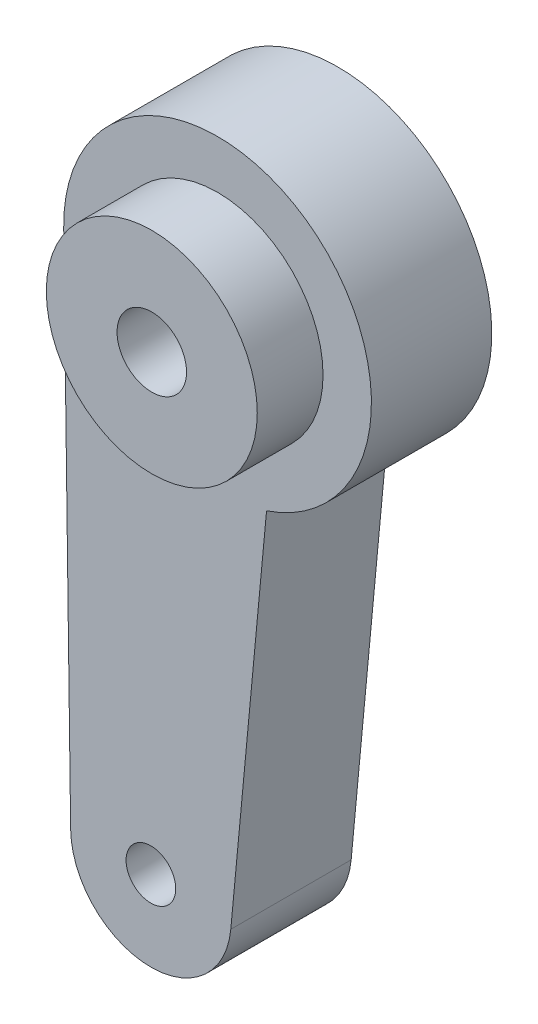
ISO-10303-21;
HEADER;
FILE_DESCRIPTION(('STEP AP214'),'2;1');
FILE_NAME('part.step','',(''),(''),'','','');
FILE_SCHEMA(('AUTOMOTIVE_DESIGN { 1 0 10303 214 1 1 1 1 }'));
ENDSEC;
DATA;
#1=APPLICATION_CONTEXT('core data for automotive mechanical design processes');
#2=APPLICATION_PROTOCOL_DEFINITION('international standard','automotive_design',2000,#1);
#3=PRODUCT_CONTEXT('',#1,'mechanical');
#4=PRODUCT('Part','Part','',(#3));
#5=PRODUCT_RELATED_PRODUCT_CATEGORY('part','',(#4));
#6=PRODUCT_DEFINITION_FORMATION('','',#4);
#7=PRODUCT_DEFINITION_CONTEXT('part definition',#1,'design');
#8=PRODUCT_DEFINITION('design','',#6,#7);
#9=PRODUCT_DEFINITION_SHAPE('','',#8);
#10=(LENGTH_UNIT() NAMED_UNIT(*) SI_UNIT(.MILLI.,.METRE.));
#11=(NAMED_UNIT(*) PLANE_ANGLE_UNIT() SI_UNIT($,.RADIAN.));
#12=(NAMED_UNIT(*) SI_UNIT($,.STERADIAN.) SOLID_ANGLE_UNIT());
#13=UNCERTAINTY_MEASURE_WITH_UNIT(LENGTH_MEASURE(1.E-05),#10,'distance_accuracy_value','');
#14=(GEOMETRIC_REPRESENTATION_CONTEXT(3) GLOBAL_UNCERTAINTY_ASSIGNED_CONTEXT((#13)) GLOBAL_UNIT_ASSIGNED_CONTEXT((#10,
#11,#12)) REPRESENTATION_CONTEXT('',''));
#15=CARTESIAN_POINT('',(0.,0.,0.));
#16=DIRECTION('',(0.,0.,1.));
#17=DIRECTION('',(1.,0.,0.));
#18=AXIS2_PLACEMENT_3D('',#15,#16,#17);
#19=CARTESIAN_POINT('',(-5.37200033269533,-41.7935021123179,9.7));
#20=DIRECTION('',(0.,0.,-1.));
#21=DIRECTION('',(-1.,0.,0.));
#22=AXIS2_PLACEMENT_3D('',#19,#20,#21);
#23=PLANE('',#22);
#24=CARTESIAN_POINT('',(-5.37200033269533,-41.7935021123179,9.7));
#25=DIRECTION('',(0.,0.,1.));
#26=DIRECTION('',(-1.,0.,0.));
#27=AXIS2_PLACEMENT_3D('',#24,#25,#26);
#28=CIRCLE('',#27,2.);
#29=CARTESIAN_POINT('',(-7.37200033269533,-41.7935021123179,9.7));
#30=VERTEX_POINT('',#29);
#31=EDGE_CURVE('E119',#30,#30,#28,.T.);
#32=ORIENTED_EDGE('',*,*,#31,.F.);
#33=EDGE_LOOP('',(#32));
#34=FACE_BOUND('',#33,.T.);
#35=CARTESIAN_POINT('',(-5.37200033269533,-41.7935021123179,9.7));
#36=DIRECTION('',(0.,0.,1.));
#37=DIRECTION('',(-1.,0.,0.));
#38=AXIS2_PLACEMENT_3D('',#35,#36,#37);
#39=CIRCLE('',#38,6.46671710257156);
#40=CARTESIAN_POINT('',(-11.8381351287015,-41.8802827816509,9.7));
#41=VERTEX_POINT('',#40);
#42=CARTESIAN_POINT('',(1.06630854635583,-42.3989844511376,9.7));
#43=VERTEX_POINT('',#42);
#44=EDGE_CURVE('E85',#41,#43,#39,.T.);
#45=ORIENTED_EDGE('',*,*,#44,.T.);
#46=DIRECTION('',(0.0936305592491223,0.995607010006808,0.));
#47=VECTOR('',#46,1.);
#48=CARTESIAN_POINT('',(3.94830943408032,-11.7536448347212,9.7));
#49=LINE('',#48,#47);
#50=CARTESIAN_POINT('',(3.94830943408032,-11.7536448347212,9.7));
#51=VERTEX_POINT('',#50);
#52=EDGE_CURVE('E80',#43,#51,#49,.T.);
#53=ORIENTED_EDGE('',*,*,#52,.T.);
#54=CARTESIAN_POINT('',(0.,0.,9.7));
#55=DIRECTION('',(0.,0.,1.));
#56=DIRECTION('',(-1.,0.,0.));
#57=AXIS2_PLACEMENT_3D('',#54,#55,#56);
#58=CIRCLE('',#57,12.3990852198062);
#59=CARTESIAN_POINT('',(-12.3979687230407,-0.166390596252117,9.7));
#60=VERTEX_POINT('',#59);
#61=EDGE_CURVE('E83',#51,#60,#58,.T.);
#62=ORIENTED_EDGE('',*,*,#61,.T.);
#63=DIRECTION('',(0.013419586469679,-0.999909953295287,0.));
#64=VECTOR('',#63,1.);
#65=CARTESIAN_POINT('',(-12.3979687230407,-0.166390596252109,9.7));
#66=LINE('',#65,#64);
#67=EDGE_CURVE('E49',#60,#41,#66,.T.);
#68=ORIENTED_EDGE('',*,*,#67,.T.);
#69=EDGE_LOOP('',(#45,#53,#62,#68));
#70=FACE_BOUND('',#69,.T.);
#71=CARTESIAN_POINT('',(0.,0.,9.7));
#72=DIRECTION('',(0.,0.,-1.));
#73=DIRECTION('',(-1.,0.,0.));
#74=AXIS2_PLACEMENT_3D('',#71,#72,#73);
#75=CIRCLE('',#74,8.5);
#76=CARTESIAN_POINT('',(-8.5,0.,9.7));
#77=VERTEX_POINT('',#76);
#78=EDGE_CURVE('E11',#77,#77,#75,.F.);
#79=ORIENTED_EDGE('',*,*,#78,.F.);
#80=EDGE_LOOP('',(#79));
#81=FACE_BOUND('',#80,.T.);
#82=ADVANCED_FACE('F32',(#34,#70,#81),#23,.F.);
#83=CARTESIAN_POINT('',(-5.37200033269533,-41.7935021123179,0.));
#84=DIRECTION('',(0.,0.,-1.));
#85=DIRECTION('',(-1.,0.,0.));
#86=AXIS2_PLACEMENT_3D('',#83,#84,#85);
#87=PLANE('',#86);
#88=CARTESIAN_POINT('',(0.,0.,0.));
#89=DIRECTION('',(0.,0.,1.));
#90=DIRECTION('',(-1.,0.,0.));
#91=AXIS2_PLACEMENT_3D('',#88,#89,#90);
#92=CIRCLE('',#91,5.5);
#93=CARTESIAN_POINT('',(-5.5,0.,0.));
#94=VERTEX_POINT('',#93);
#95=EDGE_CURVE('E102',#94,#94,#92,.T.);
#96=ORIENTED_EDGE('',*,*,#95,.T.);
#97=EDGE_LOOP('',(#96));
#98=FACE_BOUND('',#97,.T.);
#99=CARTESIAN_POINT('',(-5.37200033269533,-41.7935021123179,0.));
#100=DIRECTION('',(0.,0.,1.));
#101=DIRECTION('',(-1.,0.,0.));
#102=AXIS2_PLACEMENT_3D('',#99,#100,#101);
#103=CIRCLE('',#102,6.46671710257156);
#104=CARTESIAN_POINT('',(-11.8381351287015,-41.8802827816509,0.));
#105=VERTEX_POINT('',#104);
#106=CARTESIAN_POINT('',(1.06630854635583,-42.3989844511376,0.));
#107=VERTEX_POINT('',#106);
#108=EDGE_CURVE('E99',#105,#107,#103,.T.);
#109=ORIENTED_EDGE('',*,*,#108,.F.);
#110=DIRECTION('',(0.013419586469679,-0.999909953295287,0.));
#111=VECTOR('',#110,1.);
#112=CARTESIAN_POINT('',(-12.3979687230407,-0.166390596252109,0.));
#113=LINE('',#112,#111);
#114=CARTESIAN_POINT('',(-12.3979687230407,-0.166390596252117,0.));
#115=VERTEX_POINT('',#114);
#116=EDGE_CURVE('E72',#115,#105,#113,.T.);
#117=ORIENTED_EDGE('',*,*,#116,.F.);
#118=CARTESIAN_POINT('',(0.,0.,0.));
#119=DIRECTION('',(0.,0.,1.));
#120=DIRECTION('',(-1.,0.,0.));
#121=AXIS2_PLACEMENT_3D('',#118,#119,#120);
#122=CIRCLE('',#121,12.3990852198062);
#123=CARTESIAN_POINT('',(3.94830943408032,-11.7536448347212,0.));
#124=VERTEX_POINT('',#123);
#125=EDGE_CURVE('E66',#124,#115,#122,.T.);
#126=ORIENTED_EDGE('',*,*,#125,.F.);
#127=DIRECTION('',(0.0936305592491223,0.995607010006808,0.));
#128=VECTOR('',#127,1.);
#129=CARTESIAN_POINT('',(3.94830943408032,-11.7536448347212,0.));
#130=LINE('',#129,#128);
#131=EDGE_CURVE('E90',#107,#124,#130,.T.);
#132=ORIENTED_EDGE('',*,*,#131,.F.);
#133=EDGE_LOOP('',(#109,#117,#126,#132));
#134=FACE_BOUND('',#133,.T.);
#135=CARTESIAN_POINT('',(-5.37200033269533,-41.7935021123179,0.));
#136=DIRECTION('',(0.,0.,1.));
#137=DIRECTION('',(-1.,0.,0.));
#138=AXIS2_PLACEMENT_3D('',#135,#136,#137);
#139=CIRCLE('',#138,2.);
#140=CARTESIAN_POINT('',(-7.37200033269533,-41.7935021123179,0.));
#141=VERTEX_POINT('',#140);
#142=EDGE_CURVE('E117',#141,#141,#139,.T.);
#143=ORIENTED_EDGE('',*,*,#142,.T.);
#144=EDGE_LOOP('',(#143));
#145=FACE_BOUND('',#144,.T.);
#146=ADVANCED_FACE('F110',(#98,#134,#145),#87,.T.);
#147=CARTESIAN_POINT('',(-5.37200033269533,-41.7935021123179,9.7));
#148=DIRECTION('',(0.,0.,-1.));
#149=DIRECTION('',(-1.,0.,0.));
#150=AXIS2_PLACEMENT_3D('',#147,#148,#149);
#151=CYLINDRICAL_SURFACE('',#150,6.46671710257156);
#152=ORIENTED_EDGE('',*,*,#108,.T.);
#153=DIRECTION('',(0.,0.,-1.));
#154=VECTOR('',#153,1.);
#155=CARTESIAN_POINT('',(1.06630854635583,-42.3989844511376,9.7));
#156=LINE('',#155,#154);
#157=EDGE_CURVE('E41',#43,#107,#156,.T.);
#158=ORIENTED_EDGE('',*,*,#157,.F.);
#159=ORIENTED_EDGE('',*,*,#44,.F.);
#160=DIRECTION('',(0.,0.,-1.));
#161=VECTOR('',#160,1.);
#162=CARTESIAN_POINT('',(-11.8381351287015,-41.8802827816509,9.7));
#163=LINE('',#162,#161);
#164=EDGE_CURVE('E95',#41,#105,#163,.T.);
#165=ORIENTED_EDGE('',*,*,#164,.T.);
#166=EDGE_LOOP('',(#152,#158,#159,#165));
#167=FACE_BOUND('',#166,.T.);
#168=ADVANCED_FACE('F34',(#167),#151,.T.);
#169=CARTESIAN_POINT('',(3.94830943408032,-11.7536448347212,9.7));
#170=DIRECTION('',(-0.995607010006808,0.0936305592491223,0.));
#171=DIRECTION('',(-0.0936305592491223,-0.995607010006808,0.));
#172=AXIS2_PLACEMENT_3D('',#169,#170,#171);
#173=PLANE('',#172);
#174=ORIENTED_EDGE('',*,*,#131,.T.);
#175=DIRECTION('',(0.,0.,-1.));
#176=VECTOR('',#175,1.);
#177=CARTESIAN_POINT('',(3.94830943408032,-11.7536448347212,9.7));
#178=LINE('',#177,#176);
#179=EDGE_CURVE('E88',#51,#124,#178,.T.);
#180=ORIENTED_EDGE('',*,*,#179,.F.);
#181=ORIENTED_EDGE('',*,*,#52,.F.);
#182=ORIENTED_EDGE('',*,*,#157,.T.);
#183=EDGE_LOOP('',(#174,#180,#181,#182));
#184=FACE_BOUND('',#183,.T.);
#185=ADVANCED_FACE('F89',(#184),#173,.F.);
#186=CARTESIAN_POINT('',(0.,0.,9.7));
#187=DIRECTION('',(0.,0.,-1.));
#188=DIRECTION('',(-1.,0.,0.));
#189=AXIS2_PLACEMENT_3D('',#186,#187,#188);
#190=CYLINDRICAL_SURFACE('',#189,12.3990852198062);
#191=ORIENTED_EDGE('',*,*,#125,.T.);
#192=DIRECTION('',(0.,0.,-1.));
#193=VECTOR('',#192,1.);
#194=CARTESIAN_POINT('',(-12.3979687230407,-0.166390596252117,9.7));
#195=LINE('',#194,#193);
#196=EDGE_CURVE('E91',#60,#115,#195,.T.);
#197=ORIENTED_EDGE('',*,*,#196,.F.);
#198=ORIENTED_EDGE('',*,*,#61,.F.);
#199=ORIENTED_EDGE('',*,*,#179,.T.);
#200=EDGE_LOOP('',(#191,#197,#198,#199));
#201=FACE_BOUND('',#200,.T.);
#202=ADVANCED_FACE('F93',(#201),#190,.T.);
#203=CARTESIAN_POINT('',(-12.3979687230407,-0.166390596252109,9.7));
#204=DIRECTION('',(0.999909953295287,0.013419586469679,0.));
#205=DIRECTION('',(-0.013419586469679,0.999909953295287,0.));
#206=AXIS2_PLACEMENT_3D('',#203,#204,#205);
#207=PLANE('',#206);
#208=ORIENTED_EDGE('',*,*,#116,.T.);
#209=ORIENTED_EDGE('',*,*,#164,.F.);
#210=ORIENTED_EDGE('',*,*,#67,.F.);
#211=ORIENTED_EDGE('',*,*,#196,.T.);
#212=EDGE_LOOP('',(#208,#209,#210,#211));
#213=FACE_BOUND('',#212,.T.);
#214=ADVANCED_FACE('F134',(#213),#207,.F.);
#215=CARTESIAN_POINT('',(0.,0.,9.7));
#216=DIRECTION('',(0.,0.,-1.));
#217=DIRECTION('',(-1.,0.,0.));
#218=AXIS2_PLACEMENT_3D('',#215,#216,#217);
#219=CYLINDRICAL_SURFACE('',#218,5.5);
#220=CARTESIAN_POINT('',(0.,0.,9.7));
#221=DIRECTION('',(0.,0.,1.));
#222=DIRECTION('',(1.,0.,0.));
#223=AXIS2_PLACEMENT_3D('',#220,#221,#222);
#224=CIRCLE('',#223,5.5);
#225=CARTESIAN_POINT('',(5.5,0.,9.7));
#226=VERTEX_POINT('',#225);
#227=EDGE_CURVE('E120',#226,#226,#224,.T.);
#228=ORIENTED_EDGE('',*,*,#227,.T.);
#229=EDGE_LOOP('',(#228));
#230=FACE_BOUND('',#229,.T.);
#231=ORIENTED_EDGE('',*,*,#95,.F.);
#232=EDGE_LOOP('',(#231));
#233=FACE_BOUND('',#232,.T.);
#234=ADVANCED_FACE('F131',(#230,#233),#219,.F.);
#235=CARTESIAN_POINT('',(-5.37200033269533,-41.7935021123179,9.7));
#236=DIRECTION('',(0.,0.,-1.));
#237=DIRECTION('',(-1.,0.,0.));
#238=AXIS2_PLACEMENT_3D('',#235,#236,#237);
#239=CYLINDRICAL_SURFACE('',#238,2.);
#240=ORIENTED_EDGE('',*,*,#31,.T.);
#241=EDGE_LOOP('',(#240));
#242=FACE_BOUND('',#241,.T.);
#243=ORIENTED_EDGE('',*,*,#142,.F.);
#244=EDGE_LOOP('',(#243));
#245=FACE_BOUND('',#244,.T.);
#246=ADVANCED_FACE('F133',(#242,#245),#239,.F.);
#247=CARTESIAN_POINT('',(0.,0.,15.));
#248=DIRECTION('',(0.,0.,1.));
#249=DIRECTION('',(1.,0.,0.));
#250=AXIS2_PLACEMENT_3D('',#247,#248,#249);
#251=PLANE('',#250);
#252=CARTESIAN_POINT('',(0.,0.,15.));
#253=DIRECTION('',(0.,0.,1.));
#254=DIRECTION('',(1.,0.,0.));
#255=AXIS2_PLACEMENT_3D('',#252,#253,#254);
#256=CIRCLE('',#255,8.5);
#257=CARTESIAN_POINT('',(8.5,0.,15.));
#258=VERTEX_POINT('',#257);
#259=EDGE_CURVE('E125',#258,#258,#256,.T.);
#260=ORIENTED_EDGE('',*,*,#259,.T.);
#261=EDGE_LOOP('',(#260));
#262=FACE_BOUND('',#261,.T.);
#263=CARTESIAN_POINT('',(0.,0.,15.));
#264=DIRECTION('',(0.,0.,1.));
#265=DIRECTION('',(1.,0.,0.));
#266=AXIS2_PLACEMENT_3D('',#263,#264,#265);
#267=CIRCLE('',#266,2.8);
#268=CARTESIAN_POINT('',(2.8,0.,15.));
#269=VERTEX_POINT('',#268);
#270=EDGE_CURVE('E239',#269,#269,#267,.T.);
#271=ORIENTED_EDGE('',*,*,#270,.F.);
#272=EDGE_LOOP('',(#271));
#273=FACE_BOUND('',#272,.T.);
#274=ADVANCED_FACE('F141',(#262,#273),#251,.T.);
#275=CARTESIAN_POINT('',(0.,0.,9.7));
#276=DIRECTION('',(0.,0.,1.));
#277=DIRECTION('',(1.,0.,0.));
#278=AXIS2_PLACEMENT_3D('',#275,#276,#277);
#279=PLANE('',#278);
#280=ORIENTED_EDGE('',*,*,#227,.F.);
#281=EDGE_LOOP('',(#280));
#282=FACE_BOUND('',#281,.T.);
#283=CARTESIAN_POINT('',(0.,0.,9.7));
#284=DIRECTION('',(0.,0.,1.));
#285=DIRECTION('',(1.,0.,0.));
#286=AXIS2_PLACEMENT_3D('',#283,#284,#285);
#287=CIRCLE('',#286,2.8);
#288=CARTESIAN_POINT('',(2.8,0.,9.7));
#289=VERTEX_POINT('',#288);
#290=EDGE_CURVE('E242',#289,#289,#287,.T.);
#291=ORIENTED_EDGE('',*,*,#290,.T.);
#292=EDGE_LOOP('',(#291));
#293=FACE_BOUND('',#292,.T.);
#294=ADVANCED_FACE('F202',(#282,#293),#279,.F.);
#295=CARTESIAN_POINT('',(0.,0.,15.));
#296=DIRECTION('',(0.,0.,-1.));
#297=DIRECTION('',(-1.,0.,0.));
#298=AXIS2_PLACEMENT_3D('',#295,#296,#297);
#299=CYLINDRICAL_SURFACE('',#298,8.5);
#300=ORIENTED_EDGE('',*,*,#259,.F.);
#301=EDGE_LOOP('',(#300));
#302=FACE_BOUND('',#301,.T.);
#303=ORIENTED_EDGE('',*,*,#78,.T.);
#304=EDGE_LOOP('',(#303));
#305=FACE_BOUND('',#304,.T.);
#306=ADVANCED_FACE('F211',(#302,#305),#299,.T.);
#307=CARTESIAN_POINT('',(0.,0.,15.));
#308=DIRECTION('',(0.,0.,-1.));
#309=DIRECTION('',(-1.,0.,0.));
#310=AXIS2_PLACEMENT_3D('',#307,#308,#309);
#311=CYLINDRICAL_SURFACE('',#310,2.8);
#312=ORIENTED_EDGE('',*,*,#270,.T.);
#313=EDGE_LOOP('',(#312));
#314=FACE_BOUND('',#313,.T.);
#315=ORIENTED_EDGE('',*,*,#290,.F.);
#316=EDGE_LOOP('',(#315));
#317=FACE_BOUND('',#316,.T.);
#318=ADVANCED_FACE('F220',(#314,#317),#311,.F.);
#319=CLOSED_SHELL('',(#82,#146,#168,#185,#202,#214,#234,#246,#274,#294,#306,#318));
#320=MANIFOLD_SOLID_BREP('B2',#319);
#321=ADVANCED_BREP_SHAPE_REPRESENTATION('',(#18,#320),#14);
#322=SHAPE_DEFINITION_REPRESENTATION(#9,#321);
ENDSEC;
END-ISO-10303-21;
